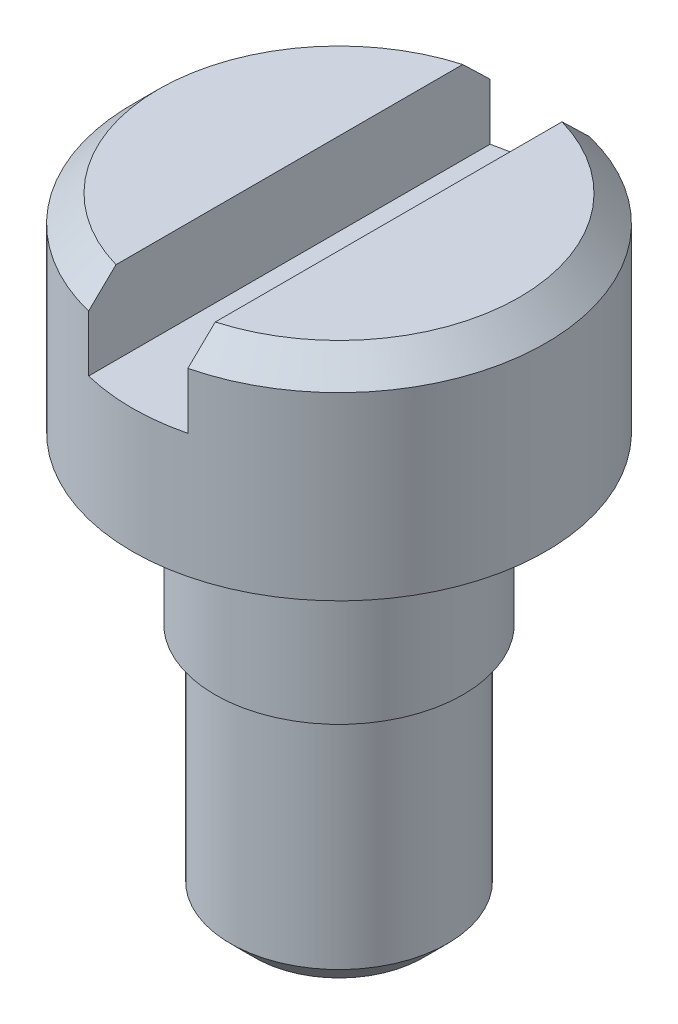
ISO-10303-21;
HEADER;
FILE_DESCRIPTION(('STEP AP214'),'2;1');
FILE_NAME('part.step','',(''),(''),'','','');
FILE_SCHEMA(('AUTOMOTIVE_DESIGN { 1 0 10303 214 1 1 1 1 }'));
ENDSEC;
DATA;
#1=APPLICATION_CONTEXT('core data for automotive mechanical design processes');
#2=APPLICATION_PROTOCOL_DEFINITION('international standard','automotive_design',2000,#1);
#3=PRODUCT_CONTEXT('',#1,'mechanical');
#4=PRODUCT('Part','Part','',(#3));
#5=PRODUCT_RELATED_PRODUCT_CATEGORY('part','',(#4));
#6=PRODUCT_DEFINITION_FORMATION('','',#4);
#7=PRODUCT_DEFINITION_CONTEXT('part definition',#1,'design');
#8=PRODUCT_DEFINITION('design','',#6,#7);
#9=PRODUCT_DEFINITION_SHAPE('','',#8);
#10=(LENGTH_UNIT() NAMED_UNIT(*) SI_UNIT(.MILLI.,.METRE.));
#11=(NAMED_UNIT(*) PLANE_ANGLE_UNIT() SI_UNIT($,.RADIAN.));
#12=(NAMED_UNIT(*) SI_UNIT($,.STERADIAN.) SOLID_ANGLE_UNIT());
#13=UNCERTAINTY_MEASURE_WITH_UNIT(LENGTH_MEASURE(1.E-05),#10,'distance_accuracy_value','');
#14=(GEOMETRIC_REPRESENTATION_CONTEXT(3) GLOBAL_UNCERTAINTY_ASSIGNED_CONTEXT((#13)) GLOBAL_UNIT_ASSIGNED_CONTEXT((#10,
#11,#12)) REPRESENTATION_CONTEXT('',''));
#15=CARTESIAN_POINT('',(0.,0.,0.));
#16=DIRECTION('',(0.,0.,1.));
#17=DIRECTION('',(1.,0.,0.));
#18=AXIS2_PLACEMENT_3D('',#15,#16,#17);
#19=CARTESIAN_POINT('',(0.,-3.175,0.));
#20=DIRECTION('',(0.,-1.,0.));
#21=DIRECTION('',(0.,0.,-1.));
#22=AXIS2_PLACEMENT_3D('',#19,#20,#21);
#23=PLANE('',#22);
#24=CARTESIAN_POINT('',(0.,-3.175,0.));
#25=DIRECTION('',(0.,-1.,0.));
#26=DIRECTION('',(0.,0.,-1.));
#27=AXIS2_PLACEMENT_3D('',#24,#25,#26);
#28=CIRCLE('',#27,2.38125);
#29=CARTESIAN_POINT('',(0.,-3.175,-2.38125));
#30=VERTEX_POINT('',#29);
#31=EDGE_CURVE('E111',#30,#30,#28,.T.);
#32=ORIENTED_EDGE('',*,*,#31,.T.);
#33=EDGE_LOOP('',(#32));
#34=FACE_BOUND('',#33,.T.);
#35=CARTESIAN_POINT('',(0.,-3.175,0.));
#36=DIRECTION('',(0.,-1.,0.));
#37=DIRECTION('',(0.,0.,-1.));
#38=AXIS2_PLACEMENT_3D('',#35,#36,#37);
#39=CIRCLE('',#38,2.0828);
#40=CARTESIAN_POINT('',(0.,-3.175,-2.0828));
#41=VERTEX_POINT('',#40);
#42=EDGE_CURVE('E115',#41,#41,#39,.T.);
#43=ORIENTED_EDGE('',*,*,#42,.F.);
#44=EDGE_LOOP('',(#43));
#45=FACE_BOUND('',#44,.T.);
#46=ADVANCED_FACE('F31',(#34,#45),#23,.T.);
#47=CARTESIAN_POINT('',(0.,0.,0.));
#48=DIRECTION('',(0.,1.,0.));
#49=DIRECTION('',(0.,0.,1.));
#50=AXIS2_PLACEMENT_3D('',#47,#48,#49);
#51=PLANE('',#50);
#52=CARTESIAN_POINT('',(0.,0.,0.));
#53=DIRECTION('',(0.,1.,0.));
#54=DIRECTION('',(0.,0.,1.));
#55=AXIS2_PLACEMENT_3D('',#52,#53,#54);
#56=CIRCLE('',#55,3.96875);
#57=CARTESIAN_POINT('',(0.,0.,3.96875));
#58=VERTEX_POINT('',#57);
#59=EDGE_CURVE('E123',#58,#58,#56,.T.);
#60=ORIENTED_EDGE('',*,*,#59,.F.);
#61=EDGE_LOOP('',(#60));
#62=FACE_BOUND('',#61,.T.);
#63=CARTESIAN_POINT('',(0.,0.,0.));
#64=DIRECTION('',(0.,1.,0.));
#65=DIRECTION('',(0.,0.,1.));
#66=AXIS2_PLACEMENT_3D('',#63,#64,#65);
#67=CIRCLE('',#66,2.38125);
#68=CARTESIAN_POINT('',(0.,0.,2.38125));
#69=VERTEX_POINT('',#68);
#70=EDGE_CURVE('E106',#69,#69,#67,.F.);
#71=ORIENTED_EDGE('',*,*,#70,.F.);
#72=EDGE_LOOP('',(#71));
#73=FACE_BOUND('',#72,.T.);
#74=ADVANCED_FACE('F187',(#62,#73),#51,.F.);
#75=CARTESIAN_POINT('',(0.,3.96875,0.));
#76=DIRECTION('',(0.,1.,0.));
#77=DIRECTION('',(0.,0.,1.));
#78=AXIS2_PLACEMENT_3D('',#75,#76,#77);
#79=PLANE('',#78);
#80=DIRECTION('',(0.,0.,1.));
#81=VECTOR('',#80,1.);
#82=CARTESIAN_POINT('',(-0.952500000000002,3.96875,0.));
#83=LINE('',#82,#81);
#84=CARTESIAN_POINT('',(-0.952500000000002,3.96875,-3.32709096847381));
#85=VERTEX_POINT('',#84);
#86=CARTESIAN_POINT('',(-0.952500000000002,3.96875,3.32709096847381));
#87=VERTEX_POINT('',#86);
#88=EDGE_CURVE('E128',#85,#87,#83,.T.);
#89=ORIENTED_EDGE('',*,*,#88,.F.);
#90=CARTESIAN_POINT('',(0.,3.96875,0.));
#91=DIRECTION('',(0.,1.,0.));
#92=DIRECTION('',(0.,0.,1.));
#93=AXIS2_PLACEMENT_3D('',#90,#91,#92);
#94=CIRCLE('',#93,3.46075);
#95=EDGE_CURVE('E133',#85,#87,#94,.T.);
#96=ORIENTED_EDGE('',*,*,#95,.T.);
#97=EDGE_LOOP('',(#89,#96));
#98=FACE_BOUND('',#97,.T.);
#99=ADVANCED_FACE('F193',(#98),#79,.T.);
#100=CARTESIAN_POINT('',(0.,3.96875,0.));
#101=DIRECTION('',(0.,-1.,0.));
#102=DIRECTION('',(0.,0.,-1.));
#103=AXIS2_PLACEMENT_3D('',#100,#101,#102);
#104=CYLINDRICAL_SURFACE('',#103,3.96875);
#105=DIRECTION('',(0.,-1.,0.));
#106=VECTOR('',#105,1.);
#107=CARTESIAN_POINT('',(-0.952500000000002,3.96875,3.85275489909493));
#108=LINE('',#107,#106);
#109=CARTESIAN_POINT('',(-0.952500000000002,2.38125,3.85275489909493));
#110=VERTEX_POINT('',#109);
#111=CARTESIAN_POINT('',(-0.952500000000002,3.46075,3.85275489909493));
#112=VERTEX_POINT('',#111);
#113=EDGE_CURVE('E95',#110,#112,#108,.F.);
#114=ORIENTED_EDGE('',*,*,#113,.T.);
#115=CARTESIAN_POINT('',(0.,3.46075,0.));
#116=DIRECTION('',(0.,1.,0.));
#117=DIRECTION('',(0.,0.,1.));
#118=AXIS2_PLACEMENT_3D('',#115,#116,#117);
#119=CIRCLE('',#118,3.96875);
#120=CARTESIAN_POINT('',(-0.952500000000002,3.46075,-3.85275489909493));
#121=VERTEX_POINT('',#120);
#122=EDGE_CURVE('E299',#112,#121,#119,.F.);
#123=ORIENTED_EDGE('',*,*,#122,.T.);
#124=DIRECTION('',(0.,-1.,0.));
#125=VECTOR('',#124,1.);
#126=CARTESIAN_POINT('',(-0.952500000000002,3.96875,-3.85275489909493));
#127=LINE('',#126,#125);
#128=CARTESIAN_POINT('',(-0.952500000000002,2.38125,-3.85275489909493));
#129=VERTEX_POINT('',#128);
#130=EDGE_CURVE('E121',#121,#129,#127,.T.);
#131=ORIENTED_EDGE('',*,*,#130,.T.);
#132=CARTESIAN_POINT('',(0.,2.38125,0.));
#133=DIRECTION('',(0.,-1.,0.));
#134=DIRECTION('',(0.,0.,-1.));
#135=AXIS2_PLACEMENT_3D('',#132,#133,#134);
#136=CIRCLE('',#135,3.96875);
#137=CARTESIAN_POINT('',(0.952499999999998,2.38125,-3.85275489909493));
#138=VERTEX_POINT('',#137);
#139=EDGE_CURVE('E107',#129,#138,#136,.T.);
#140=ORIENTED_EDGE('',*,*,#139,.T.);
#141=DIRECTION('',(0.,-1.,0.));
#142=VECTOR('',#141,1.);
#143=CARTESIAN_POINT('',(0.952499999999998,3.96875,-3.85275489909493));
#144=LINE('',#143,#142);
#145=CARTESIAN_POINT('',(0.952499999999998,3.46075,-3.85275489909493));
#146=VERTEX_POINT('',#145);
#147=EDGE_CURVE('E96',#138,#146,#144,.F.);
#148=ORIENTED_EDGE('',*,*,#147,.T.);
#149=CARTESIAN_POINT('',(0.,3.46075,0.));
#150=DIRECTION('',(0.,1.,0.));
#151=DIRECTION('',(0.,0.,1.));
#152=AXIS2_PLACEMENT_3D('',#149,#150,#151);
#153=CIRCLE('',#152,3.96875);
#154=CARTESIAN_POINT('',(0.952499999999998,3.46075,3.85275489909493));
#155=VERTEX_POINT('',#154);
#156=EDGE_CURVE('E93',#146,#155,#153,.F.);
#157=ORIENTED_EDGE('',*,*,#156,.T.);
#158=DIRECTION('',(0.,-1.,0.));
#159=VECTOR('',#158,1.);
#160=CARTESIAN_POINT('',(0.952499999999998,3.96875,3.85275489909493));
#161=LINE('',#160,#159);
#162=CARTESIAN_POINT('',(0.952499999999998,2.38125,3.85275489909493));
#163=VERTEX_POINT('',#162);
#164=EDGE_CURVE('E86',#155,#163,#161,.T.);
#165=ORIENTED_EDGE('',*,*,#164,.T.);
#166=EDGE_CURVE('E91',#163,#110,#136,.T.);
#167=ORIENTED_EDGE('',*,*,#166,.T.);
#168=EDGE_LOOP('',(#114,#123,#131,#140,#148,#157,#165,#167));
#169=FACE_BOUND('',#168,.T.);
#170=ORIENTED_EDGE('',*,*,#59,.T.);
#171=EDGE_LOOP('',(#170));
#172=FACE_BOUND('',#171,.T.);
#173=ADVANCED_FACE('F89',(#169,#172),#104,.T.);
#174=DIRECTION('',(0.,0.,-1.));
#175=VECTOR('',#174,1.);
#176=CARTESIAN_POINT('',(0.952499999999998,3.96875,0.));
#177=LINE('',#176,#175);
#178=CARTESIAN_POINT('',(0.952499999999998,3.96875,3.32709096847381));
#179=VERTEX_POINT('',#178);
#180=CARTESIAN_POINT('',(0.952499999999998,3.96875,-3.32709096847381));
#181=VERTEX_POINT('',#180);
#182=EDGE_CURVE('E126',#179,#181,#177,.T.);
#183=ORIENTED_EDGE('',*,*,#182,.F.);
#184=CARTESIAN_POINT('',(0.,3.96875,0.));
#185=DIRECTION('',(0.,1.,0.));
#186=DIRECTION('',(0.,0.,1.));
#187=AXIS2_PLACEMENT_3D('',#184,#185,#186);
#188=CIRCLE('',#187,3.46075);
#189=EDGE_CURVE('E298',#179,#181,#188,.T.);
#190=ORIENTED_EDGE('',*,*,#189,.T.);
#191=EDGE_LOOP('',(#183,#190));
#192=FACE_BOUND('',#191,.T.);
#193=ADVANCED_FACE('F163',(#192),#79,.T.);
#194=CARTESIAN_POINT('',(-0.952500000000002,2.38125,3.96875));
#195=DIRECTION('',(0.,-1.,0.));
#196=DIRECTION('',(0.,0.,-1.));
#197=AXIS2_PLACEMENT_3D('',#194,#195,#196);
#198=PLANE('',#197);
#199=DIRECTION('',(0.,0.,-1.));
#200=VECTOR('',#199,1.);
#201=CARTESIAN_POINT('',(0.952499999999998,2.38125,3.96875));
#202=LINE('',#201,#200);
#203=EDGE_CURVE('E103',#163,#138,#202,.T.);
#204=ORIENTED_EDGE('',*,*,#203,.T.);
#205=ORIENTED_EDGE('',*,*,#139,.F.);
#206=DIRECTION('',(0.,0.,1.));
#207=VECTOR('',#206,1.);
#208=CARTESIAN_POINT('',(-0.952500000000002,2.38125,3.96875));
#209=LINE('',#208,#207);
#210=EDGE_CURVE('E105',#129,#110,#209,.T.);
#211=ORIENTED_EDGE('',*,*,#210,.T.);
#212=ORIENTED_EDGE('',*,*,#166,.F.);
#213=EDGE_LOOP('',(#204,#205,#211,#212));
#214=FACE_BOUND('',#213,.T.);
#215=ADVANCED_FACE('F101',(#214),#198,.F.);
#216=CARTESIAN_POINT('',(-0.952500000000002,2.38125,3.96875));
#217=DIRECTION('',(-1.,0.,0.));
#218=DIRECTION('',(0.,0.,1.));
#219=AXIS2_PLACEMENT_3D('',#216,#217,#218);
#220=PLANE('',#219);
#221=ORIENTED_EDGE('',*,*,#88,.T.);
#222=CARTESIAN_POINT('',(-0.952500000000002,3.96875,3.32709096847381));
#223=CARTESIAN_POINT('',(-0.952500000000002,3.8842951209755,3.41490631143013));
#224=CARTESIAN_POINT('',(-0.952500000000002,3.79973434388954,3.50261931482671));
#225=CARTESIAN_POINT('',(-0.952500000000002,3.63040101051388,3.67784062499284));
#226=CARTESIAN_POINT('',(-0.952500000000002,3.54562845426651,3.76534893180331));
#227=CARTESIAN_POINT('',(-0.952500000000002,3.46075,3.85275489909493));
#228=B_SPLINE_CURVE_WITH_KNOTS('',3,(#222,#223,#224,#225,#226,#227),.UNSPECIFIED.,.F.,.F.,(4,2,
4),(0.,0.365509047598091,0.7310180221554),.UNSPECIFIED.);
#229=EDGE_CURVE('E143',#87,#112,#228,.T.);
#230=ORIENTED_EDGE('',*,*,#229,.T.);
#231=ORIENTED_EDGE('',*,*,#113,.F.);
#232=ORIENTED_EDGE('',*,*,#210,.F.);
#233=ORIENTED_EDGE('',*,*,#130,.F.);
#234=CARTESIAN_POINT('',(-0.952500000000002,3.46075,-3.85275489909493));
#235=CARTESIAN_POINT('',(-0.952500000000002,3.54562845426651,-3.76534893180331));
#236=CARTESIAN_POINT('',(-0.952500000000002,3.63040101051388,-3.67784062499285));
#237=CARTESIAN_POINT('',(-0.952500000000002,3.79973434388954,-3.50261931482671));
#238=CARTESIAN_POINT('',(-0.952500000000002,3.8842951209755,-3.41490631143013));
#239=CARTESIAN_POINT('',(-0.952500000000002,3.96875,-3.32709096847381));
#240=B_SPLINE_CURVE_WITH_KNOTS('',3,(#234,#235,#236,#237,#238,#239),.UNSPECIFIED.,.F.,.F.,(4,2,
4),(0.,0.365508974557309,0.731018022155399),.UNSPECIFIED.);
#241=EDGE_CURVE('E136',#121,#85,#240,.T.);
#242=ORIENTED_EDGE('',*,*,#241,.T.);
#243=EDGE_LOOP('',(#221,#230,#231,#232,#233,#242));
#244=FACE_BOUND('',#243,.T.);
#245=ADVANCED_FACE('F151',(#244),#220,.F.);
#246=CARTESIAN_POINT('',(0.952499999999998,2.38125,3.96875));
#247=DIRECTION('',(1.,0.,0.));
#248=DIRECTION('',(0.,0.,-1.));
#249=AXIS2_PLACEMENT_3D('',#246,#247,#248);
#250=PLANE('',#249);
#251=ORIENTED_EDGE('',*,*,#182,.T.);
#252=CARTESIAN_POINT('',(0.952499999999998,3.96875,-3.32709096847381));
#253=CARTESIAN_POINT('',(0.952499999999998,3.8842951209755,-3.41490631143013));
#254=CARTESIAN_POINT('',(0.952499999999998,3.79973434388954,-3.50261931482671));
#255=CARTESIAN_POINT('',(0.952499999999998,3.63040101051388,-3.67784062499285));
#256=CARTESIAN_POINT('',(0.952499999999998,3.54562845426651,-3.76534893180331));
#257=CARTESIAN_POINT('',(0.952499999999998,3.46075,-3.85275489909493));
#258=B_SPLINE_CURVE_WITH_KNOTS('',3,(#252,#253,#254,#255,#256,#257),.UNSPECIFIED.,.F.,.F.,(4,2,
4),(0.,0.365509047598091,0.731018022155401),.UNSPECIFIED.);
#259=EDGE_CURVE('E46',#181,#146,#258,.T.);
#260=ORIENTED_EDGE('',*,*,#259,.T.);
#261=ORIENTED_EDGE('',*,*,#147,.F.);
#262=ORIENTED_EDGE('',*,*,#203,.F.);
#263=ORIENTED_EDGE('',*,*,#164,.F.);
#264=CARTESIAN_POINT('',(0.952499999999998,3.46075,3.85275489909493));
#265=CARTESIAN_POINT('',(0.952499999999998,3.54562845426651,3.76534893180331));
#266=CARTESIAN_POINT('',(0.952499999999998,3.63040101051388,3.67784062499285));
#267=CARTESIAN_POINT('',(0.952499999999998,3.79973434388954,3.50261931482671));
#268=CARTESIAN_POINT('',(0.952499999999998,3.8842951209755,3.41490631143013));
#269=CARTESIAN_POINT('',(0.952499999999998,3.96875,3.32709096847381));
#270=B_SPLINE_CURVE_WITH_KNOTS('',3,(#264,#265,#266,#267,#268,#269),.UNSPECIFIED.,.F.,.F.,(4,2,
4),(0.,0.365508974557309,0.7310180221554),.UNSPECIFIED.);
#271=EDGE_CURVE('E54',#155,#179,#270,.T.);
#272=ORIENTED_EDGE('',*,*,#271,.T.);
#273=EDGE_LOOP('',(#251,#260,#261,#262,#263,#272));
#274=FACE_BOUND('',#273,.T.);
#275=ADVANCED_FACE('F110',(#274),#250,.F.);
#276=CARTESIAN_POINT('',(0.,-3.175,0.));
#277=DIRECTION('',(0.,1.,0.));
#278=DIRECTION('',(0.,0.,1.));
#279=AXIS2_PLACEMENT_3D('',#276,#277,#278);
#280=CYLINDRICAL_SURFACE('',#279,2.38125);
#281=ORIENTED_EDGE('',*,*,#31,.F.);
#282=EDGE_LOOP('',(#281));
#283=FACE_BOUND('',#282,.T.);
#284=ORIENTED_EDGE('',*,*,#70,.T.);
#285=EDGE_LOOP('',(#284));
#286=FACE_BOUND('',#285,.T.);
#287=ADVANCED_FACE('F162',(#283,#286),#280,.T.);
#288=CARTESIAN_POINT('',(0.,-7.9375,0.));
#289=DIRECTION('',(0.,1.,0.));
#290=DIRECTION('',(0.,0.,1.));
#291=AXIS2_PLACEMENT_3D('',#288,#289,#290);
#292=CYLINDRICAL_SURFACE('',#291,2.0828);
#293=CARTESIAN_POINT('',(0.,-7.46125,0.));
#294=DIRECTION('',(0.,-1.,0.));
#295=DIRECTION('',(0.,0.,-1.));
#296=AXIS2_PLACEMENT_3D('',#293,#294,#295);
#297=CIRCLE('',#296,2.0828);
#298=CARTESIAN_POINT('',(0.,-7.46125,-2.0828));
#299=VERTEX_POINT('',#298);
#300=EDGE_CURVE('E11',#299,#299,#297,.F.);
#301=ORIENTED_EDGE('',*,*,#300,.T.);
#302=EDGE_LOOP('',(#301));
#303=FACE_BOUND('',#302,.T.);
#304=ORIENTED_EDGE('',*,*,#42,.T.);
#305=EDGE_LOOP('',(#304));
#306=FACE_BOUND('',#305,.T.);
#307=ADVANCED_FACE('F197',(#303,#306),#292,.T.);
#308=CARTESIAN_POINT('',(0.,-7.9375,0.));
#309=DIRECTION('',(0.,-1.,0.));
#310=DIRECTION('',(0.,0.,-1.));
#311=AXIS2_PLACEMENT_3D('',#308,#309,#310);
#312=PLANE('',#311);
#313=CARTESIAN_POINT('',(0.,-7.9375,0.));
#314=DIRECTION('',(0.,-1.,0.));
#315=DIRECTION('',(0.,0.,-1.));
#316=AXIS2_PLACEMENT_3D('',#313,#314,#315);
#317=CIRCLE('',#316,1.60655000000001);
#318=CARTESIAN_POINT('',(0.,-7.9375,-1.60655000000001));
#319=VERTEX_POINT('',#318);
#320=EDGE_CURVE('E39',#319,#319,#317,.T.);
#321=ORIENTED_EDGE('',*,*,#320,.T.);
#322=EDGE_LOOP('',(#321));
#323=FACE_BOUND('',#322,.T.);
#324=ADVANCED_FACE('F184',(#323),#312,.T.);
#325=CARTESIAN_POINT('',(0.,3.96875,0.));
#326=DIRECTION('',(0.,-1.,0.));
#327=DIRECTION('',(0.,0.,-1.));
#328=AXIS2_PLACEMENT_3D('',#325,#326,#327);
#329=CONICAL_SURFACE('',#328,3.46075,0.785398163397447);
#330=ORIENTED_EDGE('',*,*,#241,.F.);
#331=ORIENTED_EDGE('',*,*,#122,.F.);
#332=ORIENTED_EDGE('',*,*,#229,.F.);
#333=ORIENTED_EDGE('',*,*,#95,.F.);
#334=EDGE_LOOP('',(#330,#331,#332,#333));
#335=FACE_BOUND('',#334,.T.);
#336=ADVANCED_FACE('F148',(#335),#329,.T.);
#337=CARTESIAN_POINT('',(0.,3.96875,0.));
#338=DIRECTION('',(0.,-1.,0.));
#339=DIRECTION('',(0.,0.,-1.));
#340=AXIS2_PLACEMENT_3D('',#337,#338,#339);
#341=CONICAL_SURFACE('',#340,3.46075,0.785398163397447);
#342=ORIENTED_EDGE('',*,*,#271,.F.);
#343=ORIENTED_EDGE('',*,*,#156,.F.);
#344=ORIENTED_EDGE('',*,*,#259,.F.);
#345=ORIENTED_EDGE('',*,*,#189,.F.);
#346=EDGE_LOOP('',(#342,#343,#344,#345));
#347=FACE_BOUND('',#346,.T.);
#348=ADVANCED_FACE('F175',(#347),#341,.T.);
#349=CARTESIAN_POINT('',(0.,-7.9375,0.));
#350=DIRECTION('',(0.,1.,0.));
#351=DIRECTION('',(0.,0.,1.));
#352=AXIS2_PLACEMENT_3D('',#349,#350,#351);
#353=CONICAL_SURFACE('',#352,1.60655000000001,0.785398163397447);
#354=ORIENTED_EDGE('',*,*,#300,.F.);
#355=EDGE_LOOP('',(#354));
#356=FACE_BOUND('',#355,.T.);
#357=ORIENTED_EDGE('',*,*,#320,.F.);
#358=EDGE_LOOP('',(#357));
#359=FACE_BOUND('',#358,.T.);
#360=ADVANCED_FACE('F33',(#356,#359),#353,.T.);
#361=CLOSED_SHELL('',(#46,#74,#99,#173,#193,#215,#245,#275,#287,#307,#324,#336,#348,#360));
#362=MANIFOLD_SOLID_BREP('B2',#361);
#363=ADVANCED_BREP_SHAPE_REPRESENTATION('',(#18,#362),#14);
#364=SHAPE_DEFINITION_REPRESENTATION(#9,#363);
ENDSEC;
END-ISO-10303-21;
